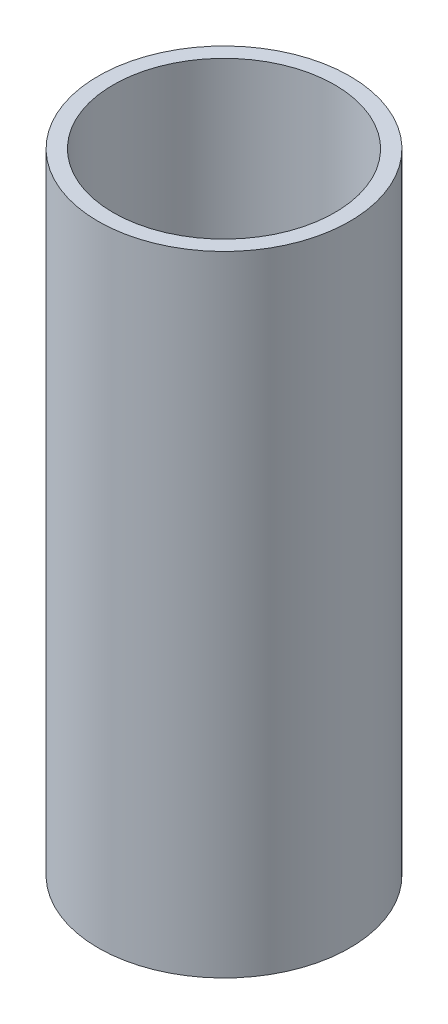
ISO-10303-21;
HEADER;
FILE_DESCRIPTION(('STEP AP214'),'2;1');
FILE_NAME('part.step','',(''),(''),'','','');
FILE_SCHEMA(('AUTOMOTIVE_DESIGN { 1 0 10303 214 1 1 1 1 }'));
ENDSEC;
DATA;
#1=APPLICATION_CONTEXT('core data for automotive mechanical design processes');
#2=APPLICATION_PROTOCOL_DEFINITION('international standard','automotive_design',2000,#1);
#3=PRODUCT_CONTEXT('',#1,'mechanical');
#4=PRODUCT('Part','Part','',(#3));
#5=PRODUCT_RELATED_PRODUCT_CATEGORY('part','',(#4));
#6=PRODUCT_DEFINITION_FORMATION('','',#4);
#7=PRODUCT_DEFINITION_CONTEXT('part definition',#1,'design');
#8=PRODUCT_DEFINITION('design','',#6,#7);
#9=PRODUCT_DEFINITION_SHAPE('','',#8);
#10=(LENGTH_UNIT() NAMED_UNIT(*) SI_UNIT(.MILLI.,.METRE.));
#11=(NAMED_UNIT(*) PLANE_ANGLE_UNIT() SI_UNIT($,.RADIAN.));
#12=(NAMED_UNIT(*) SI_UNIT($,.STERADIAN.) SOLID_ANGLE_UNIT());
#13=UNCERTAINTY_MEASURE_WITH_UNIT(LENGTH_MEASURE(1.E-05),#10,'distance_accuracy_value','');
#14=(GEOMETRIC_REPRESENTATION_CONTEXT(3) GLOBAL_UNCERTAINTY_ASSIGNED_CONTEXT((#13)) GLOBAL_UNIT_ASSIGNED_CONTEXT((#10,
#11,#12)) REPRESENTATION_CONTEXT('',''));
#15=CARTESIAN_POINT('',(0.,0.,0.));
#16=DIRECTION('',(0.,0.,1.));
#17=DIRECTION('',(1.,0.,0.));
#18=AXIS2_PLACEMENT_3D('',#15,#16,#17);
#19=CARTESIAN_POINT('',(0.,125.,0.));
#20=DIRECTION('',(0.,1.,0.));
#21=DIRECTION('',(0.,0.,1.));
#22=AXIS2_PLACEMENT_3D('',#19,#20,#21);
#23=PLANE('',#22);
#24=CARTESIAN_POINT('',(0.,125.,0.));
#25=DIRECTION('',(0.,1.,0.));
#26=DIRECTION('',(0.,0.,1.));
#27=AXIS2_PLACEMENT_3D('',#24,#25,#26);
#28=CIRCLE('',#27,25.);
#29=CARTESIAN_POINT('',(0.,125.,25.));
#30=VERTEX_POINT('',#29);
#31=EDGE_CURVE('E10',#30,#30,#28,.T.);
#32=ORIENTED_EDGE('',*,*,#31,.T.);
#33=EDGE_LOOP('',(#32));
#34=FACE_BOUND('',#33,.T.);
#35=CARTESIAN_POINT('',(0.,125.,0.));
#36=DIRECTION('',(0.,1.,0.));
#37=DIRECTION('',(0.,0.,1.));
#38=AXIS2_PLACEMENT_3D('',#35,#36,#37);
#39=CIRCLE('',#38,22.);
#40=CARTESIAN_POINT('',(0.,125.,22.));
#41=VERTEX_POINT('',#40);
#42=EDGE_CURVE('E50',#41,#41,#39,.T.);
#43=ORIENTED_EDGE('',*,*,#42,.F.);
#44=EDGE_LOOP('',(#43));
#45=FACE_BOUND('',#44,.T.);
#46=ADVANCED_FACE('F37',(#34,#45),#23,.T.);
#47=CARTESIAN_POINT('',(0.,0.,0.));
#48=DIRECTION('',(0.,1.,0.));
#49=DIRECTION('',(0.,0.,1.));
#50=AXIS2_PLACEMENT_3D('',#47,#48,#49);
#51=PLANE('',#50);
#52=CARTESIAN_POINT('',(0.,0.,0.));
#53=DIRECTION('',(0.,1.,0.));
#54=DIRECTION('',(0.,0.,1.));
#55=AXIS2_PLACEMENT_3D('',#52,#53,#54);
#56=CIRCLE('',#55,25.);
#57=CARTESIAN_POINT('',(0.,0.,25.));
#58=VERTEX_POINT('',#57);
#59=EDGE_CURVE('E41',#58,#58,#56,.T.);
#60=ORIENTED_EDGE('',*,*,#59,.F.);
#61=EDGE_LOOP('',(#60));
#62=FACE_BOUND('',#61,.T.);
#63=CARTESIAN_POINT('',(0.,0.,0.));
#64=DIRECTION('',(0.,1.,0.));
#65=DIRECTION('',(0.,0.,1.));
#66=AXIS2_PLACEMENT_3D('',#63,#64,#65);
#67=CIRCLE('',#66,22.);
#68=CARTESIAN_POINT('',(0.,0.,22.));
#69=VERTEX_POINT('',#68);
#70=EDGE_CURVE('E52',#69,#69,#67,.T.);
#71=ORIENTED_EDGE('',*,*,#70,.T.);
#72=EDGE_LOOP('',(#71));
#73=FACE_BOUND('',#72,.T.);
#74=ADVANCED_FACE('F64',(#62,#73),#51,.F.);
#75=CARTESIAN_POINT('',(0.,125.,0.));
#76=DIRECTION('',(0.,-1.,0.));
#77=DIRECTION('',(0.,0.,-1.));
#78=AXIS2_PLACEMENT_3D('',#75,#76,#77);
#79=CYLINDRICAL_SURFACE('',#78,25.);
#80=ORIENTED_EDGE('',*,*,#31,.F.);
#81=EDGE_LOOP('',(#80));
#82=FACE_BOUND('',#81,.T.);
#83=ORIENTED_EDGE('',*,*,#59,.T.);
#84=EDGE_LOOP('',(#83));
#85=FACE_BOUND('',#84,.T.);
#86=ADVANCED_FACE('F39',(#82,#85),#79,.T.);
#87=CARTESIAN_POINT('',(0.,125.,0.));
#88=DIRECTION('',(0.,-1.,0.));
#89=DIRECTION('',(0.,0.,-1.));
#90=AXIS2_PLACEMENT_3D('',#87,#88,#89);
#91=CYLINDRICAL_SURFACE('',#90,22.);
#92=ORIENTED_EDGE('',*,*,#42,.T.);
#93=EDGE_LOOP('',(#92));
#94=FACE_BOUND('',#93,.T.);
#95=ORIENTED_EDGE('',*,*,#70,.F.);
#96=EDGE_LOOP('',(#95));
#97=FACE_BOUND('',#96,.T.);
#98=ADVANCED_FACE('F60',(#94,#97),#91,.F.);
#99=CLOSED_SHELL('',(#46,#74,#86,#98));
#100=MANIFOLD_SOLID_BREP('B2',#99);
#101=ADVANCED_BREP_SHAPE_REPRESENTATION('',(#18,#100),#14);
#102=SHAPE_DEFINITION_REPRESENTATION(#9,#101);
ENDSEC;
END-ISO-10303-21;
